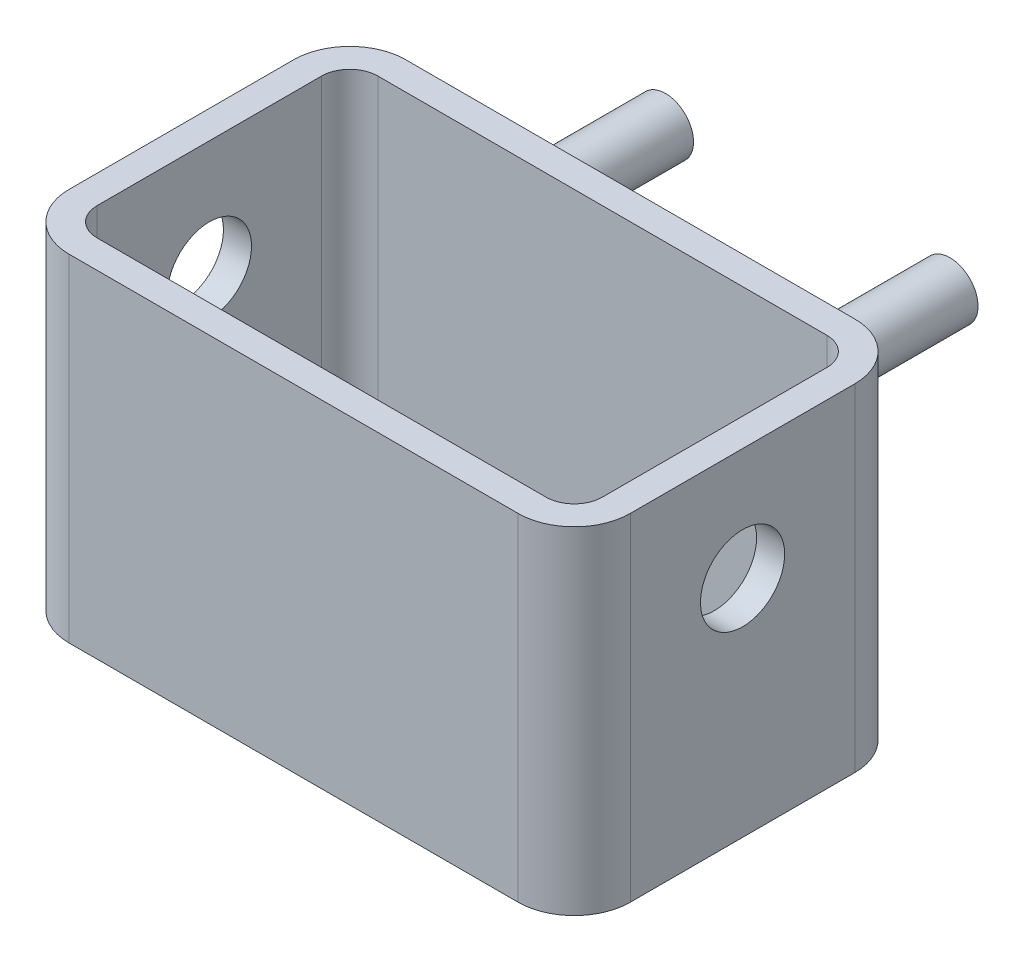
ISO-10303-21;
HEADER;
FILE_DESCRIPTION(('STEP AP214'),'2;1');
FILE_NAME('part.step','',(''),(''),'','','');
FILE_SCHEMA(('AUTOMOTIVE_DESIGN { 1 0 10303 214 1 1 1 1 }'));
ENDSEC;
DATA;
#1=APPLICATION_CONTEXT('core data for automotive mechanical design processes');
#2=APPLICATION_PROTOCOL_DEFINITION('international standard','automotive_design',2000,#1);
#3=PRODUCT_CONTEXT('',#1,'mechanical');
#4=PRODUCT('Part','Part','',(#3));
#5=PRODUCT_RELATED_PRODUCT_CATEGORY('part','',(#4));
#6=PRODUCT_DEFINITION_FORMATION('','',#4);
#7=PRODUCT_DEFINITION_CONTEXT('part definition',#1,'design');
#8=PRODUCT_DEFINITION('design','',#6,#7);
#9=PRODUCT_DEFINITION_SHAPE('','',#8);
#10=(LENGTH_UNIT() NAMED_UNIT(*) SI_UNIT(.MILLI.,.METRE.));
#11=(NAMED_UNIT(*) PLANE_ANGLE_UNIT() SI_UNIT($,.RADIAN.));
#12=(NAMED_UNIT(*) SI_UNIT($,.STERADIAN.) SOLID_ANGLE_UNIT());
#13=UNCERTAINTY_MEASURE_WITH_UNIT(LENGTH_MEASURE(1.E-05),#10,'distance_accuracy_value','');
#14=(GEOMETRIC_REPRESENTATION_CONTEXT(3) GLOBAL_UNCERTAINTY_ASSIGNED_CONTEXT((#13)) GLOBAL_UNIT_ASSIGNED_CONTEXT((#10,
#11,#12)) REPRESENTATION_CONTEXT('',''));
#15=CARTESIAN_POINT('',(0.,0.,0.));
#16=DIRECTION('',(0.,0.,1.));
#17=DIRECTION('',(1.,0.,0.));
#18=AXIS2_PLACEMENT_3D('',#15,#16,#17);
#19=CARTESIAN_POINT('',(0.,60.,0.));
#20=DIRECTION('',(0.,0.,-1.));
#21=DIRECTION('',(-1.,0.,0.));
#22=AXIS2_PLACEMENT_3D('',#19,#20,#21);
#23=PLANE('',#22);
#24=CARTESIAN_POINT('',(76.9590098941635,42.9422783006403,0.));
#25=DIRECTION('',(0.,0.,-1.));
#26=DIRECTION('',(-1.,0.,0.));
#27=AXIS2_PLACEMENT_3D('',#24,#25,#26);
#28=CIRCLE('',#27,5.00000000000001);
#29=CARTESIAN_POINT('',(71.9590098941635,42.9422783006403,0.));
#30=VERTEX_POINT('',#29);
#31=EDGE_CURVE('E374',#30,#30,#28,.T.);
#32=ORIENTED_EDGE('',*,*,#31,.F.);
#33=EDGE_LOOP('',(#32));
#34=FACE_BOUND('',#33,.T.);
#35=DIRECTION('',(1.,0.,0.));
#36=VECTOR('',#35,1.);
#37=CARTESIAN_POINT('',(0.,0.,0.));
#38=LINE('',#37,#36);
#39=CARTESIAN_POINT('',(10.,0.,0.));
#40=VERTEX_POINT('',#39);
#41=CARTESIAN_POINT('',(90.,0.,0.));
#42=VERTEX_POINT('',#41);
#43=EDGE_CURVE('E183',#40,#42,#38,.T.);
#44=ORIENTED_EDGE('',*,*,#43,.F.);
#45=DIRECTION('',(0.,-1.,0.));
#46=VECTOR('',#45,1.);
#47=CARTESIAN_POINT('',(10.,60.,0.));
#48=LINE('',#47,#46);
#49=CARTESIAN_POINT('',(10.,60.,0.));
#50=VERTEX_POINT('',#49);
#51=EDGE_CURVE('E242',#40,#50,#48,.F.);
#52=ORIENTED_EDGE('',*,*,#51,.T.);
#53=DIRECTION('',(-1.,0.,0.));
#54=VECTOR('',#53,1.);
#55=CARTESIAN_POINT('',(0.,60.,0.));
#56=LINE('',#55,#54);
#57=CARTESIAN_POINT('',(90.,60.,0.));
#58=VERTEX_POINT('',#57);
#59=EDGE_CURVE('E206',#58,#50,#56,.T.);
#60=ORIENTED_EDGE('',*,*,#59,.F.);
#61=DIRECTION('',(0.,1.,0.));
#62=VECTOR('',#61,1.);
#63=CARTESIAN_POINT('',(90.,0.,0.));
#64=LINE('',#63,#62);
#65=EDGE_CURVE('E240',#58,#42,#64,.F.);
#66=ORIENTED_EDGE('',*,*,#65,.T.);
#67=EDGE_LOOP('',(#44,#52,#60,#66));
#68=FACE_BOUND('',#67,.T.);
#69=CARTESIAN_POINT('',(26.2643499844865,42.9422783006403,0.));
#70=DIRECTION('',(0.,0.,-1.));
#71=DIRECTION('',(-1.,0.,0.));
#72=AXIS2_PLACEMENT_3D('',#69,#70,#71);
#73=CIRCLE('',#72,5.);
#74=CARTESIAN_POINT('',(21.2643499844865,42.9422783006403,0.));
#75=VERTEX_POINT('',#74);
#76=EDGE_CURVE('E375',#75,#75,#73,.T.);
#77=ORIENTED_EDGE('',*,*,#76,.F.);
#78=EDGE_LOOP('',(#77));
#79=FACE_BOUND('',#78,.T.);
#80=ADVANCED_FACE('F31',(#34,#68,#79),#23,.T.);
#81=CARTESIAN_POINT('',(0.,60.,60.));
#82=DIRECTION('',(0.,-1.,0.));
#83=DIRECTION('',(0.,0.,-1.));
#84=AXIS2_PLACEMENT_3D('',#81,#82,#83);
#85=PLANE('',#84);
#86=ORIENTED_EDGE('',*,*,#59,.T.);
#87=CARTESIAN_POINT('',(10.,60.,10.));
#88=DIRECTION('',(0.,-1.,0.));
#89=DIRECTION('',(0.,0.,-1.));
#90=AXIS2_PLACEMENT_3D('',#87,#88,#89);
#91=CIRCLE('',#90,10.);
#92=CARTESIAN_POINT('',(0.,60.,10.));
#93=VERTEX_POINT('',#92);
#94=EDGE_CURVE('E249',#50,#93,#91,.F.);
#95=ORIENTED_EDGE('',*,*,#94,.T.);
#96=DIRECTION('',(0.,0.,-1.));
#97=VECTOR('',#96,1.);
#98=CARTESIAN_POINT('',(0.,60.,60.));
#99=LINE('',#98,#97);
#100=CARTESIAN_POINT('',(0.,60.,50.));
#101=VERTEX_POINT('',#100);
#102=EDGE_CURVE('E215',#101,#93,#99,.T.);
#103=ORIENTED_EDGE('',*,*,#102,.F.);
#104=CARTESIAN_POINT('',(10.,60.,50.));
#105=DIRECTION('',(0.,-1.,0.));
#106=DIRECTION('',(0.,0.,-1.));
#107=AXIS2_PLACEMENT_3D('',#104,#105,#106);
#108=CIRCLE('',#107,10.);
#109=CARTESIAN_POINT('',(10.,60.,60.));
#110=VERTEX_POINT('',#109);
#111=EDGE_CURVE('E244',#101,#110,#108,.F.);
#112=ORIENTED_EDGE('',*,*,#111,.T.);
#113=DIRECTION('',(-1.,0.,0.));
#114=VECTOR('',#113,1.);
#115=CARTESIAN_POINT('',(0.,60.,60.));
#116=LINE('',#115,#114);
#117=CARTESIAN_POINT('',(90.,60.,60.));
#118=VERTEX_POINT('',#117);
#119=EDGE_CURVE('E212',#118,#110,#116,.T.);
#120=ORIENTED_EDGE('',*,*,#119,.F.);
#121=CARTESIAN_POINT('',(90.,60.,50.));
#122=DIRECTION('',(0.,-1.,0.));
#123=DIRECTION('',(0.,0.,-1.));
#124=AXIS2_PLACEMENT_3D('',#121,#122,#123);
#125=CIRCLE('',#124,10.);
#126=CARTESIAN_POINT('',(100.,60.,50.));
#127=VERTEX_POINT('',#126);
#128=EDGE_CURVE('E246',#118,#127,#125,.F.);
#129=ORIENTED_EDGE('',*,*,#128,.T.);
#130=DIRECTION('',(0.,0.,-1.));
#131=VECTOR('',#130,1.);
#132=CARTESIAN_POINT('',(100.,60.,60.));
#133=LINE('',#132,#131);
#134=CARTESIAN_POINT('',(100.,60.,10.));
#135=VERTEX_POINT('',#134);
#136=EDGE_CURVE('E218',#127,#135,#133,.T.);
#137=ORIENTED_EDGE('',*,*,#136,.T.);
#138=CARTESIAN_POINT('',(90.,60.,10.));
#139=DIRECTION('',(0.,-1.,0.));
#140=DIRECTION('',(0.,0.,-1.));
#141=AXIS2_PLACEMENT_3D('',#138,#139,#140);
#142=CIRCLE('',#141,10.);
#143=EDGE_CURVE('E55',#135,#58,#142,.F.);
#144=ORIENTED_EDGE('',*,*,#143,.T.);
#145=EDGE_LOOP('',(#86,#95,#103,#112,#120,#129,#137,#144));
#146=FACE_BOUND('',#145,.T.);
#147=DIRECTION('',(-1.,0.,0.));
#148=VECTOR('',#147,1.);
#149=CARTESIAN_POINT('',(0.,60.,5.));
#150=LINE('',#149,#148);
#151=CARTESIAN_POINT('',(90.,60.,5.));
#152=VERTEX_POINT('',#151);
#153=CARTESIAN_POINT('',(10.,60.,5.));
#154=VERTEX_POINT('',#153);
#155=EDGE_CURVE('E168',#152,#154,#150,.T.);
#156=ORIENTED_EDGE('',*,*,#155,.F.);
#157=CARTESIAN_POINT('',(90.,60.,10.));
#158=DIRECTION('',(0.,-1.,0.));
#159=DIRECTION('',(0.,0.,-1.));
#160=AXIS2_PLACEMENT_3D('',#157,#158,#159);
#161=CIRCLE('',#160,5.);
#162=CARTESIAN_POINT('',(95.,60.,10.));
#163=VERTEX_POINT('',#162);
#164=EDGE_CURVE('E196',#163,#152,#161,.F.);
#165=ORIENTED_EDGE('',*,*,#164,.F.);
#166=DIRECTION('',(0.,0.,-1.));
#167=VECTOR('',#166,1.);
#168=CARTESIAN_POINT('',(95.,60.,60.));
#169=LINE('',#168,#167);
#170=CARTESIAN_POINT('',(95.,60.,50.));
#171=VERTEX_POINT('',#170);
#172=EDGE_CURVE('E47',#171,#163,#169,.T.);
#173=ORIENTED_EDGE('',*,*,#172,.F.);
#174=CARTESIAN_POINT('',(90.,60.,50.));
#175=DIRECTION('',(0.,-1.,0.));
#176=DIRECTION('',(0.,0.,-1.));
#177=AXIS2_PLACEMENT_3D('',#174,#175,#176);
#178=CIRCLE('',#177,5.);
#179=CARTESIAN_POINT('',(90.,60.,55.));
#180=VERTEX_POINT('',#179);
#181=EDGE_CURVE('E176',#180,#171,#178,.F.);
#182=ORIENTED_EDGE('',*,*,#181,.F.);
#183=DIRECTION('',(-1.,0.,0.));
#184=VECTOR('',#183,1.);
#185=CARTESIAN_POINT('',(0.,60.,55.));
#186=LINE('',#185,#184);
#187=CARTESIAN_POINT('',(10.,60.,55.));
#188=VERTEX_POINT('',#187);
#189=EDGE_CURVE('E190',#180,#188,#186,.T.);
#190=ORIENTED_EDGE('',*,*,#189,.T.);
#191=CARTESIAN_POINT('',(10.,60.,50.));
#192=DIRECTION('',(0.,-1.,0.));
#193=DIRECTION('',(0.,0.,-1.));
#194=AXIS2_PLACEMENT_3D('',#191,#192,#193);
#195=CIRCLE('',#194,5.);
#196=CARTESIAN_POINT('',(5.,60.,50.));
#197=VERTEX_POINT('',#196);
#198=EDGE_CURVE('E174',#197,#188,#195,.F.);
#199=ORIENTED_EDGE('',*,*,#198,.F.);
#200=DIRECTION('',(0.,0.,-1.));
#201=VECTOR('',#200,1.);
#202=CARTESIAN_POINT('',(5.,60.,60.));
#203=LINE('',#202,#201);
#204=CARTESIAN_POINT('',(5.,60.,10.));
#205=VERTEX_POINT('',#204);
#206=EDGE_CURVE('E188',#197,#205,#203,.T.);
#207=ORIENTED_EDGE('',*,*,#206,.T.);
#208=CARTESIAN_POINT('',(10.,60.,10.));
#209=DIRECTION('',(0.,-1.,0.));
#210=DIRECTION('',(0.,0.,-1.));
#211=AXIS2_PLACEMENT_3D('',#208,#209,#210);
#212=CIRCLE('',#211,5.);
#213=EDGE_CURVE('E200',#154,#205,#212,.F.);
#214=ORIENTED_EDGE('',*,*,#213,.F.);
#215=EDGE_LOOP('',(#156,#165,#173,#182,#190,#199,#207,#214));
#216=FACE_BOUND('',#215,.T.);
#217=ADVANCED_FACE('F273',(#146,#216),#85,.F.);
#218=CARTESIAN_POINT('',(0.,0.,60.));
#219=DIRECTION('',(1.,0.,0.));
#220=DIRECTION('',(0.,0.,-1.));
#221=AXIS2_PLACEMENT_3D('',#218,#219,#220);
#222=PLANE('',#221);
#223=CARTESIAN_POINT('',(0.,40.,30.));
#224=DIRECTION('',(1.,0.,0.));
#225=DIRECTION('',(0.,0.,-1.));
#226=AXIS2_PLACEMENT_3D('',#223,#224,#225);
#227=CIRCLE('',#226,7.5);
#228=CARTESIAN_POINT('',(0.,40.,22.5));
#229=VERTEX_POINT('',#228);
#230=EDGE_CURVE('E388',#229,#229,#227,.T.);
#231=ORIENTED_EDGE('',*,*,#230,.T.);
#232=EDGE_LOOP('',(#231));
#233=FACE_BOUND('',#232,.T.);
#234=ORIENTED_EDGE('',*,*,#102,.T.);
#235=DIRECTION('',(0.,-1.,0.));
#236=VECTOR('',#235,1.);
#237=CARTESIAN_POINT('',(0.,0.,10.));
#238=LINE('',#237,#236);
#239=CARTESIAN_POINT('',(0.,0.,10.));
#240=VERTEX_POINT('',#239);
#241=EDGE_CURVE('E229',#93,#240,#238,.T.);
#242=ORIENTED_EDGE('',*,*,#241,.T.);
#243=DIRECTION('',(0.,0.,-1.));
#244=VECTOR('',#243,1.);
#245=CARTESIAN_POINT('',(0.,0.,60.));
#246=LINE('',#245,#244);
#247=CARTESIAN_POINT('',(0.,0.,50.));
#248=VERTEX_POINT('',#247);
#249=EDGE_CURVE('E224',#248,#240,#246,.T.);
#250=ORIENTED_EDGE('',*,*,#249,.F.);
#251=DIRECTION('',(0.,-1.,0.));
#252=VECTOR('',#251,1.);
#253=CARTESIAN_POINT('',(0.,0.,50.));
#254=LINE('',#253,#252);
#255=EDGE_CURVE('E227',#248,#101,#254,.F.);
#256=ORIENTED_EDGE('',*,*,#255,.T.);
#257=EDGE_LOOP('',(#234,#242,#250,#256));
#258=FACE_BOUND('',#257,.T.);
#259=ADVANCED_FACE('F33',(#233,#258),#222,.F.);
#260=CARTESIAN_POINT('',(0.,0.,60.));
#261=DIRECTION('',(0.,1.,0.));
#262=DIRECTION('',(0.,0.,1.));
#263=AXIS2_PLACEMENT_3D('',#260,#261,#262);
#264=PLANE('',#263);
#265=ORIENTED_EDGE('',*,*,#249,.T.);
#266=CARTESIAN_POINT('',(10.,0.,10.));
#267=DIRECTION('',(0.,1.,0.));
#268=DIRECTION('',(0.,0.,1.));
#269=AXIS2_PLACEMENT_3D('',#266,#267,#268);
#270=CIRCLE('',#269,10.);
#271=EDGE_CURVE('E238',#240,#40,#270,.F.);
#272=ORIENTED_EDGE('',*,*,#271,.T.);
#273=ORIENTED_EDGE('',*,*,#43,.T.);
#274=CARTESIAN_POINT('',(90.,0.,10.));
#275=DIRECTION('',(0.,1.,0.));
#276=DIRECTION('',(0.,0.,1.));
#277=AXIS2_PLACEMENT_3D('',#274,#275,#276);
#278=CIRCLE('',#277,10.);
#279=CARTESIAN_POINT('',(100.,0.,10.));
#280=VERTEX_POINT('',#279);
#281=EDGE_CURVE('E236',#42,#280,#278,.F.);
#282=ORIENTED_EDGE('',*,*,#281,.T.);
#283=DIRECTION('',(0.,0.,-1.));
#284=VECTOR('',#283,1.);
#285=CARTESIAN_POINT('',(100.,0.,60.));
#286=LINE('',#285,#284);
#287=CARTESIAN_POINT('',(100.,0.,50.));
#288=VERTEX_POINT('',#287);
#289=EDGE_CURVE('E221',#288,#280,#286,.T.);
#290=ORIENTED_EDGE('',*,*,#289,.F.);
#291=CARTESIAN_POINT('',(90.,0.,50.));
#292=DIRECTION('',(0.,1.,0.));
#293=DIRECTION('',(0.,0.,1.));
#294=AXIS2_PLACEMENT_3D('',#291,#292,#293);
#295=CIRCLE('',#294,10.);
#296=CARTESIAN_POINT('',(90.,0.,60.));
#297=VERTEX_POINT('',#296);
#298=EDGE_CURVE('E234',#288,#297,#295,.F.);
#299=ORIENTED_EDGE('',*,*,#298,.T.);
#300=DIRECTION('',(1.,0.,0.));
#301=VECTOR('',#300,1.);
#302=CARTESIAN_POINT('',(0.,0.,60.));
#303=LINE('',#302,#301);
#304=CARTESIAN_POINT('',(10.,0.,60.));
#305=VERTEX_POINT('',#304);
#306=EDGE_CURVE('E209',#305,#297,#303,.T.);
#307=ORIENTED_EDGE('',*,*,#306,.F.);
#308=CARTESIAN_POINT('',(10.,0.,50.));
#309=DIRECTION('',(0.,1.,0.));
#310=DIRECTION('',(0.,0.,1.));
#311=AXIS2_PLACEMENT_3D('',#308,#309,#310);
#312=CIRCLE('',#311,10.);
#313=EDGE_CURVE('E232',#305,#248,#312,.F.);
#314=ORIENTED_EDGE('',*,*,#313,.T.);
#315=EDGE_LOOP('',(#265,#272,#273,#282,#290,#299,#307,#314));
#316=FACE_BOUND('',#315,.T.);
#317=ADVANCED_FACE('F265',(#316),#264,.F.);
#318=CARTESIAN_POINT('',(100.,0.,60.));
#319=DIRECTION('',(-1.,0.,0.));
#320=DIRECTION('',(0.,0.,1.));
#321=AXIS2_PLACEMENT_3D('',#318,#319,#320);
#322=PLANE('',#321);
#323=CARTESIAN_POINT('',(100.,40.,30.));
#324=DIRECTION('',(1.,0.,0.));
#325=DIRECTION('',(0.,0.,-1.));
#326=AXIS2_PLACEMENT_3D('',#323,#324,#325);
#327=CIRCLE('',#326,7.5);
#328=CARTESIAN_POINT('',(100.,40.,22.5));
#329=VERTEX_POINT('',#328);
#330=EDGE_CURVE('E385',#329,#329,#327,.T.);
#331=ORIENTED_EDGE('',*,*,#330,.F.);
#332=EDGE_LOOP('',(#331));
#333=FACE_BOUND('',#332,.T.);
#334=ORIENTED_EDGE('',*,*,#289,.T.);
#335=DIRECTION('',(0.,1.,0.));
#336=VECTOR('',#335,1.);
#337=CARTESIAN_POINT('',(100.,60.,10.));
#338=LINE('',#337,#336);
#339=EDGE_CURVE('E253',#280,#135,#338,.T.);
#340=ORIENTED_EDGE('',*,*,#339,.T.);
#341=ORIENTED_EDGE('',*,*,#136,.F.);
#342=DIRECTION('',(0.,1.,0.));
#343=VECTOR('',#342,1.);
#344=CARTESIAN_POINT('',(100.,0.,50.));
#345=LINE('',#344,#343);
#346=EDGE_CURVE('E251',#127,#288,#345,.F.);
#347=ORIENTED_EDGE('',*,*,#346,.T.);
#348=EDGE_LOOP('',(#334,#340,#341,#347));
#349=FACE_BOUND('',#348,.T.);
#350=ADVANCED_FACE('F292',(#333,#349),#322,.F.);
#351=CARTESIAN_POINT('',(0.,60.,60.));
#352=DIRECTION('',(0.,0.,-1.));
#353=DIRECTION('',(-1.,0.,0.));
#354=AXIS2_PLACEMENT_3D('',#351,#352,#353);
#355=PLANE('',#354);
#356=ORIENTED_EDGE('',*,*,#306,.T.);
#357=DIRECTION('',(0.,1.,0.));
#358=VECTOR('',#357,1.);
#359=CARTESIAN_POINT('',(90.,60.,60.));
#360=LINE('',#359,#358);
#361=EDGE_CURVE('E11',#297,#118,#360,.T.);
#362=ORIENTED_EDGE('',*,*,#361,.T.);
#363=ORIENTED_EDGE('',*,*,#119,.T.);
#364=DIRECTION('',(0.,-1.,0.));
#365=VECTOR('',#364,1.);
#366=CARTESIAN_POINT('',(10.,60.,60.));
#367=LINE('',#366,#365);
#368=EDGE_CURVE('E40',#110,#305,#367,.T.);
#369=ORIENTED_EDGE('',*,*,#368,.T.);
#370=EDGE_LOOP('',(#356,#362,#363,#369));
#371=FACE_BOUND('',#370,.T.);
#372=ADVANCED_FACE('F259',(#371),#355,.F.);
#373=CARTESIAN_POINT('',(10.,0.,10.));
#374=DIRECTION('',(0.,1.,0.));
#375=DIRECTION('',(0.,0.,1.));
#376=AXIS2_PLACEMENT_3D('',#373,#374,#375);
#377=CYLINDRICAL_SURFACE('',#376,10.);
#378=ORIENTED_EDGE('',*,*,#94,.F.);
#379=ORIENTED_EDGE('',*,*,#51,.F.);
#380=ORIENTED_EDGE('',*,*,#271,.F.);
#381=ORIENTED_EDGE('',*,*,#241,.F.);
#382=EDGE_LOOP('',(#378,#379,#380,#381));
#383=FACE_BOUND('',#382,.T.);
#384=ADVANCED_FACE('F289',(#383),#377,.T.);
#385=CARTESIAN_POINT('',(90.,0.,10.));
#386=DIRECTION('',(0.,-1.,0.));
#387=DIRECTION('',(0.,0.,-1.));
#388=AXIS2_PLACEMENT_3D('',#385,#386,#387);
#389=CYLINDRICAL_SURFACE('',#388,10.);
#390=ORIENTED_EDGE('',*,*,#281,.F.);
#391=ORIENTED_EDGE('',*,*,#65,.F.);
#392=ORIENTED_EDGE('',*,*,#143,.F.);
#393=ORIENTED_EDGE('',*,*,#339,.F.);
#394=EDGE_LOOP('',(#390,#391,#392,#393));
#395=FACE_BOUND('',#394,.T.);
#396=ADVANCED_FACE('F290',(#395),#389,.T.);
#397=CARTESIAN_POINT('',(90.,60.,50.));
#398=DIRECTION('',(0.,1.,0.));
#399=DIRECTION('',(0.,0.,1.));
#400=AXIS2_PLACEMENT_3D('',#397,#398,#399);
#401=CYLINDRICAL_SURFACE('',#400,10.);
#402=ORIENTED_EDGE('',*,*,#298,.F.);
#403=ORIENTED_EDGE('',*,*,#346,.F.);
#404=ORIENTED_EDGE('',*,*,#128,.F.);
#405=ORIENTED_EDGE('',*,*,#361,.F.);
#406=EDGE_LOOP('',(#402,#403,#404,#405));
#407=FACE_BOUND('',#406,.T.);
#408=ADVANCED_FACE('F271',(#407),#401,.T.);
#409=CARTESIAN_POINT('',(10.,60.,50.));
#410=DIRECTION('',(0.,-1.,0.));
#411=DIRECTION('',(0.,0.,-1.));
#412=AXIS2_PLACEMENT_3D('',#409,#410,#411);
#413=CYLINDRICAL_SURFACE('',#412,10.);
#414=ORIENTED_EDGE('',*,*,#111,.F.);
#415=ORIENTED_EDGE('',*,*,#255,.F.);
#416=ORIENTED_EDGE('',*,*,#313,.F.);
#417=ORIENTED_EDGE('',*,*,#368,.F.);
#418=EDGE_LOOP('',(#414,#415,#416,#417));
#419=FACE_BOUND('',#418,.T.);
#420=ADVANCED_FACE('F278',(#419),#413,.T.);
#421=CARTESIAN_POINT('',(5.,0.,60.));
#422=DIRECTION('',(1.,0.,0.));
#423=DIRECTION('',(0.,0.,-1.));
#424=AXIS2_PLACEMENT_3D('',#421,#422,#423);
#425=PLANE('',#424);
#426=CARTESIAN_POINT('',(5.,40.,30.));
#427=DIRECTION('',(1.,0.,0.));
#428=DIRECTION('',(0.,0.,-1.));
#429=AXIS2_PLACEMENT_3D('',#426,#427,#428);
#430=CIRCLE('',#429,7.5);
#431=CARTESIAN_POINT('',(5.,40.,22.5));
#432=VERTEX_POINT('',#431);
#433=EDGE_CURVE('E169',#432,#432,#430,.T.);
#434=ORIENTED_EDGE('',*,*,#433,.F.);
#435=EDGE_LOOP('',(#434));
#436=FACE_BOUND('',#435,.T.);
#437=ORIENTED_EDGE('',*,*,#206,.F.);
#438=DIRECTION('',(0.,1.,0.));
#439=VECTOR('',#438,1.);
#440=CARTESIAN_POINT('',(5.,0.,50.));
#441=LINE('',#440,#439);
#442=CARTESIAN_POINT('',(5.,5.,50.));
#443=VERTEX_POINT('',#442);
#444=EDGE_CURVE('E395',#443,#197,#441,.T.);
#445=ORIENTED_EDGE('',*,*,#444,.F.);
#446=DIRECTION('',(0.,0.,-1.));
#447=VECTOR('',#446,1.);
#448=CARTESIAN_POINT('',(5.,5.,60.));
#449=LINE('',#448,#447);
#450=CARTESIAN_POINT('',(5.,5.,10.));
#451=VERTEX_POINT('',#450);
#452=EDGE_CURVE('E396',#443,#451,#449,.T.);
#453=ORIENTED_EDGE('',*,*,#452,.T.);
#454=DIRECTION('',(0.,1.,0.));
#455=VECTOR('',#454,1.);
#456=CARTESIAN_POINT('',(5.,0.,10.));
#457=LINE('',#456,#455);
#458=EDGE_CURVE('E154',#205,#451,#457,.F.);
#459=ORIENTED_EDGE('',*,*,#458,.F.);
#460=EDGE_LOOP('',(#437,#445,#453,#459));
#461=FACE_BOUND('',#460,.T.);
#462=ADVANCED_FACE('F319',(#436,#461),#425,.T.);
#463=CARTESIAN_POINT('',(0.,5.,60.));
#464=DIRECTION('',(0.,1.,0.));
#465=DIRECTION('',(0.,0.,1.));
#466=AXIS2_PLACEMENT_3D('',#463,#464,#465);
#467=PLANE('',#466);
#468=ORIENTED_EDGE('',*,*,#452,.F.);
#469=CARTESIAN_POINT('',(10.,5.,50.));
#470=DIRECTION('',(0.,1.,0.));
#471=DIRECTION('',(0.,0.,1.));
#472=AXIS2_PLACEMENT_3D('',#469,#470,#471);
#473=CIRCLE('',#472,5.);
#474=CARTESIAN_POINT('',(10.,5.,55.));
#475=VERTEX_POINT('',#474);
#476=EDGE_CURVE('E394',#475,#443,#473,.F.);
#477=ORIENTED_EDGE('',*,*,#476,.F.);
#478=DIRECTION('',(1.,0.,0.));
#479=VECTOR('',#478,1.);
#480=CARTESIAN_POINT('',(0.,5.,55.));
#481=LINE('',#480,#479);
#482=CARTESIAN_POINT('',(90.,5.,55.));
#483=VERTEX_POINT('',#482);
#484=EDGE_CURVE('E194',#475,#483,#481,.T.);
#485=ORIENTED_EDGE('',*,*,#484,.T.);
#486=CARTESIAN_POINT('',(90.,5.,50.));
#487=DIRECTION('',(0.,1.,0.));
#488=DIRECTION('',(0.,0.,1.));
#489=AXIS2_PLACEMENT_3D('',#486,#487,#488);
#490=CIRCLE('',#489,5.);
#491=CARTESIAN_POINT('',(95.,5.,50.));
#492=VERTEX_POINT('',#491);
#493=EDGE_CURVE('E400',#492,#483,#490,.F.);
#494=ORIENTED_EDGE('',*,*,#493,.F.);
#495=DIRECTION('',(0.,0.,-1.));
#496=VECTOR('',#495,1.);
#497=CARTESIAN_POINT('',(95.,5.,60.));
#498=LINE('',#497,#496);
#499=CARTESIAN_POINT('',(95.,5.,10.));
#500=VERTEX_POINT('',#499);
#501=EDGE_CURVE('E198',#492,#500,#498,.T.);
#502=ORIENTED_EDGE('',*,*,#501,.T.);
#503=CARTESIAN_POINT('',(90.,5.,10.));
#504=DIRECTION('',(0.,1.,0.));
#505=DIRECTION('',(0.,0.,1.));
#506=AXIS2_PLACEMENT_3D('',#503,#504,#505);
#507=CIRCLE('',#506,5.);
#508=CARTESIAN_POINT('',(90.,5.,5.));
#509=VERTEX_POINT('',#508);
#510=EDGE_CURVE('E159',#509,#500,#507,.F.);
#511=ORIENTED_EDGE('',*,*,#510,.F.);
#512=DIRECTION('',(1.,0.,0.));
#513=VECTOR('',#512,1.);
#514=CARTESIAN_POINT('',(0.,5.,5.));
#515=LINE('',#514,#513);
#516=CARTESIAN_POINT('',(10.,5.,5.));
#517=VERTEX_POINT('',#516);
#518=EDGE_CURVE('E163',#517,#509,#515,.T.);
#519=ORIENTED_EDGE('',*,*,#518,.F.);
#520=CARTESIAN_POINT('',(10.,5.,10.));
#521=DIRECTION('',(0.,1.,0.));
#522=DIRECTION('',(0.,0.,1.));
#523=AXIS2_PLACEMENT_3D('',#520,#521,#522);
#524=CIRCLE('',#523,5.);
#525=EDGE_CURVE('E147',#451,#517,#524,.F.);
#526=ORIENTED_EDGE('',*,*,#525,.F.);
#527=EDGE_LOOP('',(#468,#477,#485,#494,#502,#511,#519,#526));
#528=FACE_BOUND('',#527,.T.);
#529=ADVANCED_FACE('F164',(#528),#467,.T.);
#530=CARTESIAN_POINT('',(95.,0.,60.));
#531=DIRECTION('',(-1.,0.,0.));
#532=DIRECTION('',(0.,0.,1.));
#533=AXIS2_PLACEMENT_3D('',#530,#531,#532);
#534=PLANE('',#533);
#535=CARTESIAN_POINT('',(95.,40.,30.));
#536=DIRECTION('',(-1.,0.,0.));
#537=DIRECTION('',(0.,0.,1.));
#538=AXIS2_PLACEMENT_3D('',#535,#536,#537);
#539=CIRCLE('',#538,7.5);
#540=CARTESIAN_POINT('',(95.,40.,37.5));
#541=VERTEX_POINT('',#540);
#542=EDGE_CURVE('E35',#541,#541,#539,.T.);
#543=ORIENTED_EDGE('',*,*,#542,.F.);
#544=EDGE_LOOP('',(#543));
#545=FACE_BOUND('',#544,.T.);
#546=ORIENTED_EDGE('',*,*,#501,.F.);
#547=DIRECTION('',(0.,1.,0.));
#548=VECTOR('',#547,1.);
#549=CARTESIAN_POINT('',(95.,0.,50.));
#550=LINE('',#549,#548);
#551=EDGE_CURVE('E203',#171,#492,#550,.F.);
#552=ORIENTED_EDGE('',*,*,#551,.F.);
#553=ORIENTED_EDGE('',*,*,#172,.T.);
#554=DIRECTION('',(0.,1.,0.));
#555=VECTOR('',#554,1.);
#556=CARTESIAN_POINT('',(95.,0.,10.));
#557=LINE('',#556,#555);
#558=EDGE_CURVE('E187',#500,#163,#557,.T.);
#559=ORIENTED_EDGE('',*,*,#558,.F.);
#560=EDGE_LOOP('',(#546,#552,#553,#559));
#561=FACE_BOUND('',#560,.T.);
#562=ADVANCED_FACE('F340',(#545,#561),#534,.T.);
#563=CARTESIAN_POINT('',(0.,60.,55.));
#564=DIRECTION('',(0.,0.,-1.));
#565=DIRECTION('',(-1.,0.,0.));
#566=AXIS2_PLACEMENT_3D('',#563,#564,#565);
#567=PLANE('',#566);
#568=ORIENTED_EDGE('',*,*,#484,.F.);
#569=DIRECTION('',(0.,1.,0.));
#570=VECTOR('',#569,1.);
#571=CARTESIAN_POINT('',(10.,60.,55.));
#572=LINE('',#571,#570);
#573=EDGE_CURVE('E184',#188,#475,#572,.F.);
#574=ORIENTED_EDGE('',*,*,#573,.F.);
#575=ORIENTED_EDGE('',*,*,#189,.F.);
#576=DIRECTION('',(0.,1.,0.));
#577=VECTOR('',#576,1.);
#578=CARTESIAN_POINT('',(90.,60.,55.));
#579=LINE('',#578,#577);
#580=EDGE_CURVE('E181',#483,#180,#579,.T.);
#581=ORIENTED_EDGE('',*,*,#580,.F.);
#582=EDGE_LOOP('',(#568,#574,#575,#581));
#583=FACE_BOUND('',#582,.T.);
#584=ADVANCED_FACE('F337',(#583),#567,.T.);
#585=CARTESIAN_POINT('',(0.,60.,5.));
#586=DIRECTION('',(0.,0.,-1.));
#587=DIRECTION('',(-1.,0.,0.));
#588=AXIS2_PLACEMENT_3D('',#585,#586,#587);
#589=PLANE('',#588);
#590=ORIENTED_EDGE('',*,*,#518,.T.);
#591=DIRECTION('',(0.,1.,0.));
#592=VECTOR('',#591,1.);
#593=CARTESIAN_POINT('',(90.,60.,5.));
#594=LINE('',#593,#592);
#595=EDGE_CURVE('E158',#152,#509,#594,.F.);
#596=ORIENTED_EDGE('',*,*,#595,.F.);
#597=ORIENTED_EDGE('',*,*,#155,.T.);
#598=DIRECTION('',(0.,1.,0.));
#599=VECTOR('',#598,1.);
#600=CARTESIAN_POINT('',(10.,60.,5.));
#601=LINE('',#600,#599);
#602=EDGE_CURVE('E151',#517,#154,#601,.T.);
#603=ORIENTED_EDGE('',*,*,#602,.F.);
#604=EDGE_LOOP('',(#590,#596,#597,#603));
#605=FACE_BOUND('',#604,.T.);
#606=ADVANCED_FACE('F171',(#605),#589,.F.);
#607=CARTESIAN_POINT('',(10.,0.,10.));
#608=DIRECTION('',(0.,1.,0.));
#609=DIRECTION('',(0.,0.,1.));
#610=AXIS2_PLACEMENT_3D('',#607,#608,#609);
#611=CYLINDRICAL_SURFACE('',#610,5.);
#612=ORIENTED_EDGE('',*,*,#213,.T.);
#613=ORIENTED_EDGE('',*,*,#458,.T.);
#614=ORIENTED_EDGE('',*,*,#525,.T.);
#615=ORIENTED_EDGE('',*,*,#602,.T.);
#616=EDGE_LOOP('',(#612,#613,#614,#615));
#617=FACE_BOUND('',#616,.T.);
#618=ADVANCED_FACE('F149',(#617),#611,.F.);
#619=CARTESIAN_POINT('',(90.,0.,10.));
#620=DIRECTION('',(0.,-1.,0.));
#621=DIRECTION('',(0.,0.,-1.));
#622=AXIS2_PLACEMENT_3D('',#619,#620,#621);
#623=CYLINDRICAL_SURFACE('',#622,5.);
#624=ORIENTED_EDGE('',*,*,#510,.T.);
#625=ORIENTED_EDGE('',*,*,#558,.T.);
#626=ORIENTED_EDGE('',*,*,#164,.T.);
#627=ORIENTED_EDGE('',*,*,#595,.T.);
#628=EDGE_LOOP('',(#624,#625,#626,#627));
#629=FACE_BOUND('',#628,.T.);
#630=ADVANCED_FACE('F328',(#629),#623,.F.);
#631=CARTESIAN_POINT('',(90.,60.,50.));
#632=DIRECTION('',(0.,1.,0.));
#633=DIRECTION('',(0.,0.,1.));
#634=AXIS2_PLACEMENT_3D('',#631,#632,#633);
#635=CYLINDRICAL_SURFACE('',#634,5.);
#636=ORIENTED_EDGE('',*,*,#493,.T.);
#637=ORIENTED_EDGE('',*,*,#580,.T.);
#638=ORIENTED_EDGE('',*,*,#181,.T.);
#639=ORIENTED_EDGE('',*,*,#551,.T.);
#640=EDGE_LOOP('',(#636,#637,#638,#639));
#641=FACE_BOUND('',#640,.T.);
#642=ADVANCED_FACE('F324',(#641),#635,.F.);
#643=CARTESIAN_POINT('',(10.,60.,50.));
#644=DIRECTION('',(0.,-1.,0.));
#645=DIRECTION('',(0.,0.,-1.));
#646=AXIS2_PLACEMENT_3D('',#643,#644,#645);
#647=CYLINDRICAL_SURFACE('',#646,5.);
#648=ORIENTED_EDGE('',*,*,#198,.T.);
#649=ORIENTED_EDGE('',*,*,#573,.T.);
#650=ORIENTED_EDGE('',*,*,#476,.T.);
#651=ORIENTED_EDGE('',*,*,#444,.T.);
#652=EDGE_LOOP('',(#648,#649,#650,#651));
#653=FACE_BOUND('',#652,.T.);
#654=ADVANCED_FACE('F320',(#653),#647,.F.);
#655=CARTESIAN_POINT('',(0.,40.,30.));
#656=DIRECTION('',(1.,0.,0.));
#657=DIRECTION('',(0.,0.,-1.));
#658=AXIS2_PLACEMENT_3D('',#655,#656,#657);
#659=CYLINDRICAL_SURFACE('',#658,7.5);
#660=ORIENTED_EDGE('',*,*,#542,.T.);
#661=EDGE_LOOP('',(#660));
#662=FACE_BOUND('',#661,.T.);
#663=ORIENTED_EDGE('',*,*,#330,.T.);
#664=EDGE_LOOP('',(#663));
#665=FACE_BOUND('',#664,.T.);
#666=ADVANCED_FACE('F323',(#662,#665),#659,.F.);
#667=ORIENTED_EDGE('',*,*,#433,.T.);
#668=EDGE_LOOP('',(#667));
#669=FACE_BOUND('',#668,.T.);
#670=ORIENTED_EDGE('',*,*,#230,.F.);
#671=EDGE_LOOP('',(#670));
#672=FACE_BOUND('',#671,.T.);
#673=ADVANCED_FACE('F352',(#669,#672),#659,.F.);
#674=CARTESIAN_POINT('',(76.9590098941635,42.9422783006403,-30.));
#675=DIRECTION('',(0.,0.,1.));
#676=DIRECTION('',(1.,0.,0.));
#677=AXIS2_PLACEMENT_3D('',#674,#675,#676);
#678=CYLINDRICAL_SURFACE('',#677,5.00000000000001);
#679=CARTESIAN_POINT('',(76.9590098941635,42.9422783006403,-30.));
#680=DIRECTION('',(0.,0.,-1.));
#681=DIRECTION('',(-1.,0.,0.));
#682=AXIS2_PLACEMENT_3D('',#679,#680,#681);
#683=CIRCLE('',#682,5.00000000000001);
#684=CARTESIAN_POINT('',(71.9590098941635,42.9422783006403,-30.));
#685=VERTEX_POINT('',#684);
#686=EDGE_CURVE('E378',#685,#685,#683,.T.);
#687=ORIENTED_EDGE('',*,*,#686,.F.);
#688=EDGE_LOOP('',(#687));
#689=FACE_BOUND('',#688,.T.);
#690=ORIENTED_EDGE('',*,*,#31,.T.);
#691=EDGE_LOOP('',(#690));
#692=FACE_BOUND('',#691,.T.);
#693=ADVANCED_FACE('F354',(#689,#692),#678,.T.);
#694=CARTESIAN_POINT('',(76.9590098941635,42.9422783006403,-30.));
#695=DIRECTION('',(0.,0.,-1.));
#696=DIRECTION('',(-1.,0.,0.));
#697=AXIS2_PLACEMENT_3D('',#694,#695,#696);
#698=PLANE('',#697);
#699=ORIENTED_EDGE('',*,*,#686,.T.);
#700=EDGE_LOOP('',(#699));
#701=FACE_BOUND('',#700,.T.);
#702=ADVANCED_FACE('F357',(#701),#698,.T.);
#703=CARTESIAN_POINT('',(26.2643499844865,42.9422783006403,-30.));
#704=DIRECTION('',(0.,0.,1.));
#705=DIRECTION('',(1.,0.,0.));
#706=AXIS2_PLACEMENT_3D('',#703,#704,#705);
#707=CYLINDRICAL_SURFACE('',#706,5.);
#708=CARTESIAN_POINT('',(26.2643499844865,42.9422783006403,-30.));
#709=DIRECTION('',(0.,0.,-1.));
#710=DIRECTION('',(-1.,0.,0.));
#711=AXIS2_PLACEMENT_3D('',#708,#709,#710);
#712=CIRCLE('',#711,5.);
#713=CARTESIAN_POINT('',(21.2643499844865,42.9422783006403,-30.));
#714=VERTEX_POINT('',#713);
#715=EDGE_CURVE('E373',#714,#714,#712,.T.);
#716=ORIENTED_EDGE('',*,*,#715,.F.);
#717=EDGE_LOOP('',(#716));
#718=FACE_BOUND('',#717,.T.);
#719=ORIENTED_EDGE('',*,*,#76,.T.);
#720=EDGE_LOOP('',(#719));
#721=FACE_BOUND('',#720,.T.);
#722=ADVANCED_FACE('F361',(#718,#721),#707,.T.);
#723=CARTESIAN_POINT('',(26.2643499844865,42.9422783006403,-30.));
#724=DIRECTION('',(0.,0.,-1.));
#725=DIRECTION('',(-1.,0.,0.));
#726=AXIS2_PLACEMENT_3D('',#723,#724,#725);
#727=PLANE('',#726);
#728=ORIENTED_EDGE('',*,*,#715,.T.);
#729=EDGE_LOOP('',(#728));
#730=FACE_BOUND('',#729,.T.);
#731=ADVANCED_FACE('F365',(#730),#727,.T.);
#732=CLOSED_SHELL('',(#80,#217,#259,#317,#350,#372,#384,#396,#408,#420,#462,#529,#562,#584,#606,
#618,#630,#642,#654,#666,#673,#693,#702,#722,#731));
#733=MANIFOLD_SOLID_BREP('B2',#732);
#734=ADVANCED_BREP_SHAPE_REPRESENTATION('',(#18,#733),#14);
#735=SHAPE_DEFINITION_REPRESENTATION(#9,#734);
ENDSEC;
END-ISO-10303-21;
